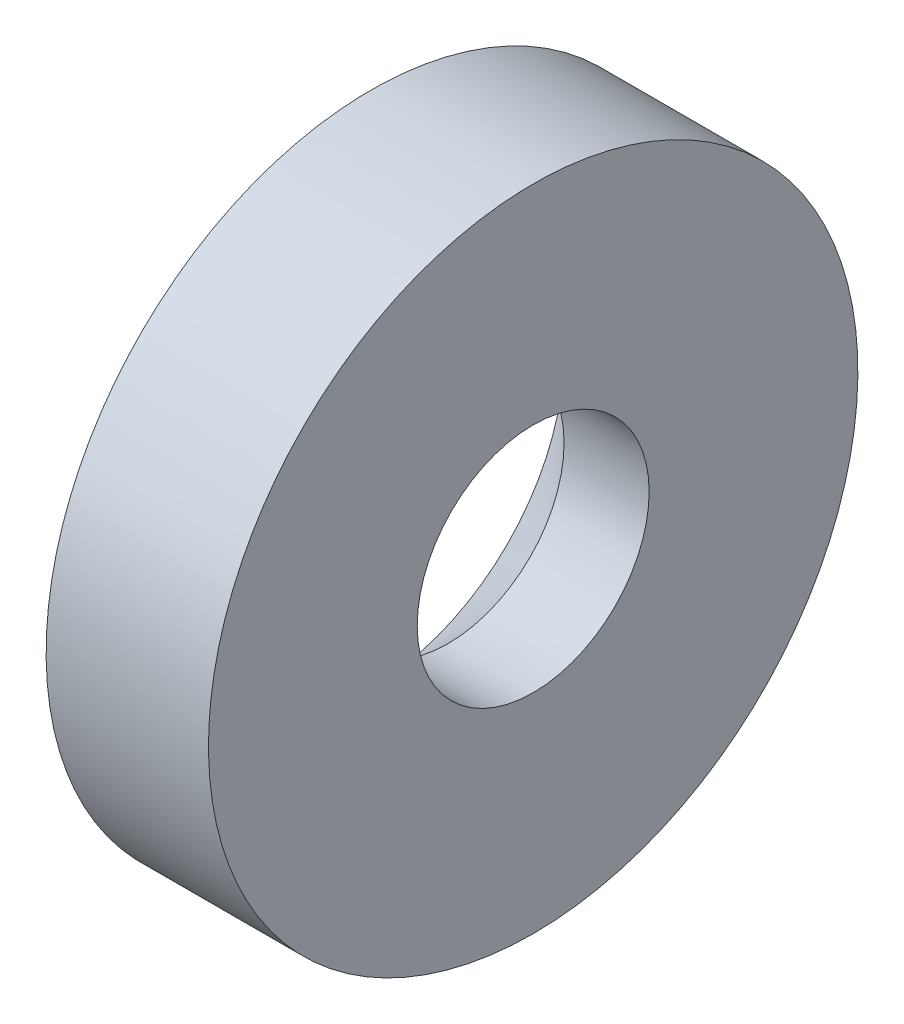
ISO-10303-21;
HEADER;
FILE_DESCRIPTION(('STEP AP214'),'2;1');
FILE_NAME('part.step','',(''),(''),'','','');
FILE_SCHEMA(('AUTOMOTIVE_DESIGN { 1 0 10303 214 1 1 1 1 }'));
ENDSEC;
DATA;
#1=APPLICATION_CONTEXT('core data for automotive mechanical design processes');
#2=APPLICATION_PROTOCOL_DEFINITION('international standard','automotive_design',2000,#1);
#3=PRODUCT_CONTEXT('',#1,'mechanical');
#4=PRODUCT('Part','Part','',(#3));
#5=PRODUCT_RELATED_PRODUCT_CATEGORY('part','',(#4));
#6=PRODUCT_DEFINITION_FORMATION('','',#4);
#7=PRODUCT_DEFINITION_CONTEXT('part definition',#1,'design');
#8=PRODUCT_DEFINITION('design','',#6,#7);
#9=PRODUCT_DEFINITION_SHAPE('','',#8);
#10=(LENGTH_UNIT() NAMED_UNIT(*) SI_UNIT(.MILLI.,.METRE.));
#11=(NAMED_UNIT(*) PLANE_ANGLE_UNIT() SI_UNIT($,.RADIAN.));
#12=(NAMED_UNIT(*) SI_UNIT($,.STERADIAN.) SOLID_ANGLE_UNIT());
#13=UNCERTAINTY_MEASURE_WITH_UNIT(LENGTH_MEASURE(1.E-05),#10,'distance_accuracy_value','');
#14=(GEOMETRIC_REPRESENTATION_CONTEXT(3) GLOBAL_UNCERTAINTY_ASSIGNED_CONTEXT((#13)) GLOBAL_UNIT_ASSIGNED_CONTEXT((#10,
#11,#12)) REPRESENTATION_CONTEXT('',''));
#15=CARTESIAN_POINT('',(0.,0.,0.));
#16=DIRECTION('',(0.,0.,1.));
#17=DIRECTION('',(1.,0.,0.));
#18=AXIS2_PLACEMENT_3D('',#15,#16,#17);
#19=CARTESIAN_POINT('',(17.75,0.,0.));
#20=DIRECTION('',(1.,0.,0.));
#21=DIRECTION('',(0.,1.,0.));
#22=AXIS2_PLACEMENT_3D('',#19,#20,#21);
#23=CYLINDRICAL_SURFACE('',#22,7.5);
#24=CARTESIAN_POINT('',(20.5,0.,0.));
#25=DIRECTION('',(1.,0.,0.));
#26=DIRECTION('',(0.,0.,-1.));
#27=AXIS2_PLACEMENT_3D('',#24,#25,#26);
#28=CIRCLE('',#27,7.5);
#29=CARTESIAN_POINT('',(20.5,-7.5,0.));
#30=VERTEX_POINT('',#29);
#31=EDGE_CURVE('E19',#30,#30,#28,.T.);
#32=ORIENTED_EDGE('',*,*,#31,.T.);
#33=DIRECTION('',(-1.,0.,0.));
#34=VECTOR('',#33,1.);
#35=CARTESIAN_POINT('',(17.75,-7.5,0.));
#36=LINE('',#35,#34);
#37=CARTESIAN_POINT('',(15.,-7.5,0.));
#38=VERTEX_POINT('',#37);
#39=EDGE_CURVE('E9',#30,#38,#36,.T.);
#40=ORIENTED_EDGE('',*,*,#39,.T.);
#41=CARTESIAN_POINT('',(15.,0.,0.));
#42=DIRECTION('',(1.,0.,0.));
#43=DIRECTION('',(0.,0.,-1.));
#44=AXIS2_PLACEMENT_3D('',#41,#42,#43);
#45=CIRCLE('',#44,7.5);
#46=EDGE_CURVE('E74',#38,#38,#45,.T.);
#47=ORIENTED_EDGE('',*,*,#46,.F.);
#48=ORIENTED_EDGE('',*,*,#39,.F.);
#49=EDGE_LOOP('',(#32,#40,#47,#48));
#50=FACE_BOUND('',#49,.T.);
#51=ADVANCED_FACE('F15',(#50),#23,.F.);
#52=CARTESIAN_POINT('',(20.5,7.5,0.));
#53=DIRECTION('',(1.,0.,0.));
#54=DIRECTION('',(0.,-1.,0.));
#55=AXIS2_PLACEMENT_3D('',#52,#53,#54);
#56=PLANE('',#55);
#57=ORIENTED_EDGE('',*,*,#31,.F.);
#58=EDGE_LOOP('',(#57));
#59=FACE_BOUND('',#58,.T.);
#60=CARTESIAN_POINT('',(20.5,0.,0.));
#61=DIRECTION('',(1.,0.,0.));
#62=DIRECTION('',(0.,0.,-1.));
#63=AXIS2_PLACEMENT_3D('',#60,#61,#62);
#64=CIRCLE('',#63,21.);
#65=CARTESIAN_POINT('',(20.5,-21.,0.));
#66=VERTEX_POINT('',#65);
#67=EDGE_CURVE('E72',#66,#66,#64,.T.);
#68=ORIENTED_EDGE('',*,*,#67,.T.);
#69=EDGE_LOOP('',(#68));
#70=FACE_BOUND('',#69,.T.);
#71=ADVANCED_FACE('F90',(#59,#70),#56,.T.);
#72=CARTESIAN_POINT('',(15.25,0.,0.));
#73=DIRECTION('',(1.,0.,0.));
#74=DIRECTION('',(0.,1.,0.));
#75=AXIS2_PLACEMENT_3D('',#72,#73,#74);
#76=CYLINDRICAL_SURFACE('',#75,21.);
#77=ORIENTED_EDGE('',*,*,#67,.F.);
#78=DIRECTION('',(-1.,0.,0.));
#79=VECTOR('',#78,1.);
#80=CARTESIAN_POINT('',(15.25,-21.,0.));
#81=LINE('',#80,#79);
#82=CARTESIAN_POINT('',(10.,-21.,0.));
#83=VERTEX_POINT('',#82);
#84=EDGE_CURVE('E51',#66,#83,#81,.T.);
#85=ORIENTED_EDGE('',*,*,#84,.T.);
#86=CARTESIAN_POINT('',(10.,0.,0.));
#87=DIRECTION('',(1.,0.,0.));
#88=DIRECTION('',(0.,0.,-1.));
#89=AXIS2_PLACEMENT_3D('',#86,#87,#88);
#90=CIRCLE('',#89,21.);
#91=EDGE_CURVE('E64',#83,#83,#90,.T.);
#92=ORIENTED_EDGE('',*,*,#91,.T.);
#93=ORIENTED_EDGE('',*,*,#84,.F.);
#94=EDGE_LOOP('',(#77,#85,#92,#93));
#95=FACE_BOUND('',#94,.T.);
#96=ADVANCED_FACE('F93',(#95),#76,.T.);
#97=CARTESIAN_POINT('',(10.,21.,0.));
#98=DIRECTION('',(-1.,0.,0.));
#99=DIRECTION('',(0.,0.,1.));
#100=AXIS2_PLACEMENT_3D('',#97,#98,#99);
#101=PLANE('',#100);
#102=CARTESIAN_POINT('',(10.,0.,0.));
#103=DIRECTION('',(1.,0.,0.));
#104=DIRECTION('',(0.,0.,-1.));
#105=AXIS2_PLACEMENT_3D('',#102,#103,#104);
#106=CIRCLE('',#105,12.5);
#107=CARTESIAN_POINT('',(10.,-12.5,0.));
#108=VERTEX_POINT('',#107);
#109=EDGE_CURVE('E57',#108,#108,#106,.T.);
#110=ORIENTED_EDGE('',*,*,#109,.T.);
#111=EDGE_LOOP('',(#110));
#112=FACE_BOUND('',#111,.T.);
#113=ORIENTED_EDGE('',*,*,#91,.F.);
#114=EDGE_LOOP('',(#113));
#115=FACE_BOUND('',#114,.T.);
#116=ADVANCED_FACE('F58',(#112,#115),#101,.T.);
#117=CARTESIAN_POINT('',(12.5,0.,0.));
#118=DIRECTION('',(-1.,0.,0.));
#119=DIRECTION('',(0.,1.,0.));
#120=AXIS2_PLACEMENT_3D('',#117,#118,#119);
#121=CONICAL_SURFACE('',#120,10.,0.785398163397448);
#122=ORIENTED_EDGE('',*,*,#46,.T.);
#123=DIRECTION('',(-0.707106781186549,-0.707106781186546,0.));
#124=VECTOR('',#123,1.);
#125=CARTESIAN_POINT('',(12.5,-10.,0.));
#126=LINE('',#125,#124);
#127=EDGE_CURVE('E65',#38,#108,#126,.T.);
#128=ORIENTED_EDGE('',*,*,#127,.T.);
#129=ORIENTED_EDGE('',*,*,#109,.F.);
#130=ORIENTED_EDGE('',*,*,#127,.F.);
#131=EDGE_LOOP('',(#122,#128,#129,#130));
#132=FACE_BOUND('',#131,.T.);
#133=ADVANCED_FACE('F17',(#132),#121,.F.);
#134=CLOSED_SHELL('',(#51,#71,#96,#116,#133));
#135=MANIFOLD_SOLID_BREP('B1',#134);
#136=ADVANCED_BREP_SHAPE_REPRESENTATION('',(#18,#135),#14);
#137=SHAPE_DEFINITION_REPRESENTATION(#9,#136);
ENDSEC;
END-ISO-10303-21;
